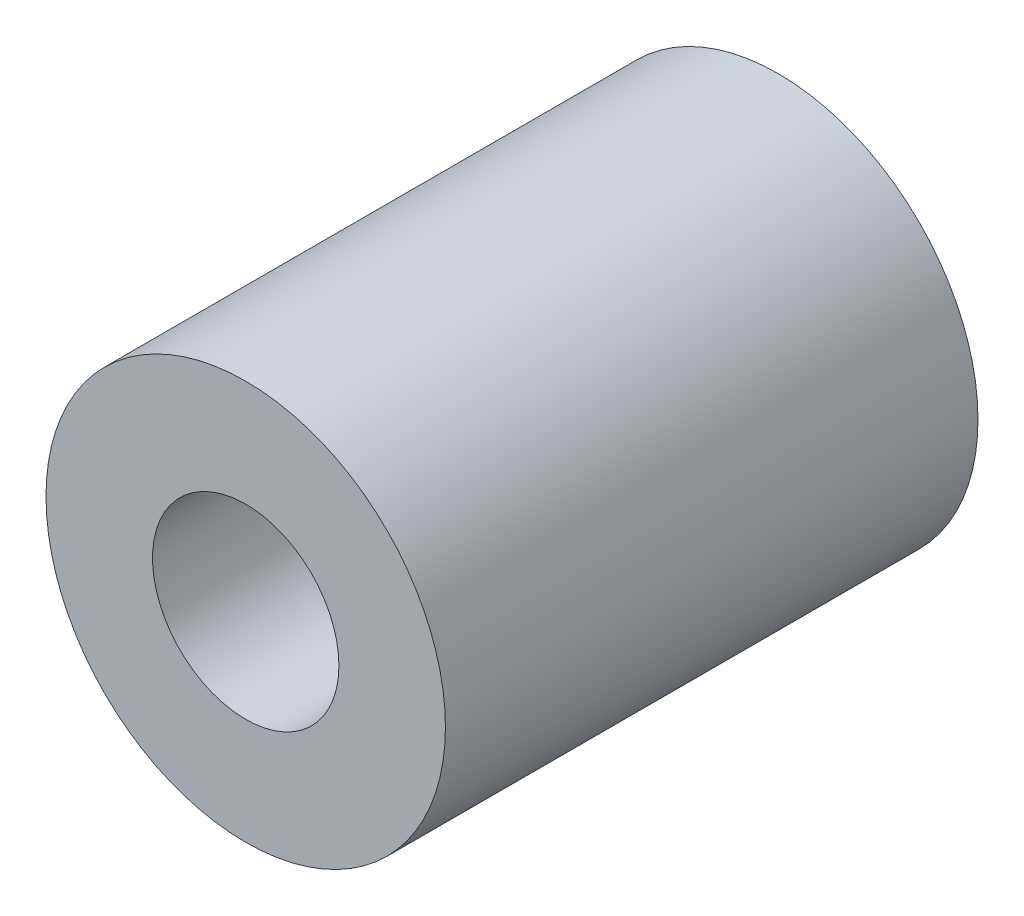
ISO-10303-21;
HEADER;
FILE_DESCRIPTION(('STEP AP214'),'2;1');
FILE_NAME('part.step','',(''),(''),'','','');
FILE_SCHEMA(('AUTOMOTIVE_DESIGN { 1 0 10303 214 1 1 1 1 }'));
ENDSEC;
DATA;
#1=APPLICATION_CONTEXT('core data for automotive mechanical design processes');
#2=APPLICATION_PROTOCOL_DEFINITION('international standard','automotive_design',2000,#1);
#3=PRODUCT_CONTEXT('',#1,'mechanical');
#4=PRODUCT('Part','Part','',(#3));
#5=PRODUCT_RELATED_PRODUCT_CATEGORY('part','',(#4));
#6=PRODUCT_DEFINITION_FORMATION('','',#4);
#7=PRODUCT_DEFINITION_CONTEXT('part definition',#1,'design');
#8=PRODUCT_DEFINITION('design','',#6,#7);
#9=PRODUCT_DEFINITION_SHAPE('','',#8);
#10=(LENGTH_UNIT() NAMED_UNIT(*) SI_UNIT(.MILLI.,.METRE.));
#11=(NAMED_UNIT(*) PLANE_ANGLE_UNIT() SI_UNIT($,.RADIAN.));
#12=(NAMED_UNIT(*) SI_UNIT($,.STERADIAN.) SOLID_ANGLE_UNIT());
#13=UNCERTAINTY_MEASURE_WITH_UNIT(LENGTH_MEASURE(1.E-05),#10,'distance_accuracy_value','');
#14=(GEOMETRIC_REPRESENTATION_CONTEXT(3) GLOBAL_UNCERTAINTY_ASSIGNED_CONTEXT((#13)) GLOBAL_UNIT_ASSIGNED_CONTEXT((#10,
#11,#12)) REPRESENTATION_CONTEXT('',''));
#15=CARTESIAN_POINT('',(0.,0.,0.));
#16=DIRECTION('',(0.,0.,1.));
#17=DIRECTION('',(1.,0.,0.));
#18=AXIS2_PLACEMENT_3D('',#15,#16,#17);
#19=CARTESIAN_POINT('',(0.,0.,10.));
#20=DIRECTION('',(0.,0.,1.));
#21=DIRECTION('',(1.,0.,0.));
#22=AXIS2_PLACEMENT_3D('',#19,#20,#21);
#23=PLANE('',#22);
#24=CARTESIAN_POINT('',(0.,0.,10.));
#25=DIRECTION('',(0.,0.,1.));
#26=DIRECTION('',(1.,0.,0.));
#27=AXIS2_PLACEMENT_3D('',#24,#25,#26);
#28=CIRCLE('',#27,3.75);
#29=CARTESIAN_POINT('',(3.75,0.,10.));
#30=VERTEX_POINT('',#29);
#31=EDGE_CURVE('E10',#30,#30,#28,.T.);
#32=ORIENTED_EDGE('',*,*,#31,.T.);
#33=EDGE_LOOP('',(#32));
#34=FACE_BOUND('',#33,.T.);
#35=CARTESIAN_POINT('',(0.,0.,10.));
#36=DIRECTION('',(0.,0.,1.));
#37=DIRECTION('',(1.,0.,0.));
#38=AXIS2_PLACEMENT_3D('',#35,#36,#37);
#39=CIRCLE('',#38,1.75);
#40=CARTESIAN_POINT('',(1.75,0.,10.));
#41=VERTEX_POINT('',#40);
#42=EDGE_CURVE('E55',#41,#41,#39,.T.);
#43=ORIENTED_EDGE('',*,*,#42,.F.);
#44=EDGE_LOOP('',(#43));
#45=FACE_BOUND('',#44,.T.);
#46=ADVANCED_FACE('F39',(#34,#45),#23,.T.);
#47=CARTESIAN_POINT('',(0.,0.,0.));
#48=DIRECTION('',(0.,0.,1.));
#49=DIRECTION('',(1.,0.,0.));
#50=AXIS2_PLACEMENT_3D('',#47,#48,#49);
#51=PLANE('',#50);
#52=CARTESIAN_POINT('',(0.,0.,0.));
#53=DIRECTION('',(0.,0.,1.));
#54=DIRECTION('',(1.,0.,0.));
#55=AXIS2_PLACEMENT_3D('',#52,#53,#54);
#56=CIRCLE('',#55,3.75);
#57=CARTESIAN_POINT('',(3.75,0.,0.));
#58=VERTEX_POINT('',#57);
#59=EDGE_CURVE('E43',#58,#58,#56,.T.);
#60=ORIENTED_EDGE('',*,*,#59,.F.);
#61=EDGE_LOOP('',(#60));
#62=FACE_BOUND('',#61,.T.);
#63=CARTESIAN_POINT('',(0.,0.,0.));
#64=DIRECTION('',(0.,0.,1.));
#65=DIRECTION('',(1.,0.,0.));
#66=AXIS2_PLACEMENT_3D('',#63,#64,#65);
#67=CIRCLE('',#66,1.75);
#68=CARTESIAN_POINT('',(1.75,0.,0.));
#69=VERTEX_POINT('',#68);
#70=EDGE_CURVE('E57',#69,#69,#67,.T.);
#71=ORIENTED_EDGE('',*,*,#70,.T.);
#72=EDGE_LOOP('',(#71));
#73=FACE_BOUND('',#72,.T.);
#74=ADVANCED_FACE('F71',(#62,#73),#51,.F.);
#75=CARTESIAN_POINT('',(0.,0.,10.));
#76=DIRECTION('',(0.,0.,-1.));
#77=DIRECTION('',(-1.,0.,0.));
#78=AXIS2_PLACEMENT_3D('',#75,#76,#77);
#79=CYLINDRICAL_SURFACE('',#78,3.75);
#80=ORIENTED_EDGE('',*,*,#31,.F.);
#81=EDGE_LOOP('',(#80));
#82=FACE_BOUND('',#81,.T.);
#83=ORIENTED_EDGE('',*,*,#59,.T.);
#84=EDGE_LOOP('',(#83));
#85=FACE_BOUND('',#84,.T.);
#86=ADVANCED_FACE('F41',(#82,#85),#79,.T.);
#87=CARTESIAN_POINT('',(0.,0.,10.));
#88=DIRECTION('',(0.,0.,-1.));
#89=DIRECTION('',(-1.,0.,0.));
#90=AXIS2_PLACEMENT_3D('',#87,#88,#89);
#91=CYLINDRICAL_SURFACE('',#90,1.75);
#92=ORIENTED_EDGE('',*,*,#42,.T.);
#93=EDGE_LOOP('',(#92));
#94=FACE_BOUND('',#93,.T.);
#95=ORIENTED_EDGE('',*,*,#70,.F.);
#96=EDGE_LOOP('',(#95));
#97=FACE_BOUND('',#96,.T.);
#98=ADVANCED_FACE('F67',(#94,#97),#91,.F.);
#99=CLOSED_SHELL('',(#46,#74,#86,#98));
#100=MANIFOLD_SOLID_BREP('B2',#99);
#101=ADVANCED_BREP_SHAPE_REPRESENTATION('',(#18,#100),#14);
#102=SHAPE_DEFINITION_REPRESENTATION(#9,#101);
ENDSEC;
END-ISO-10303-21;
